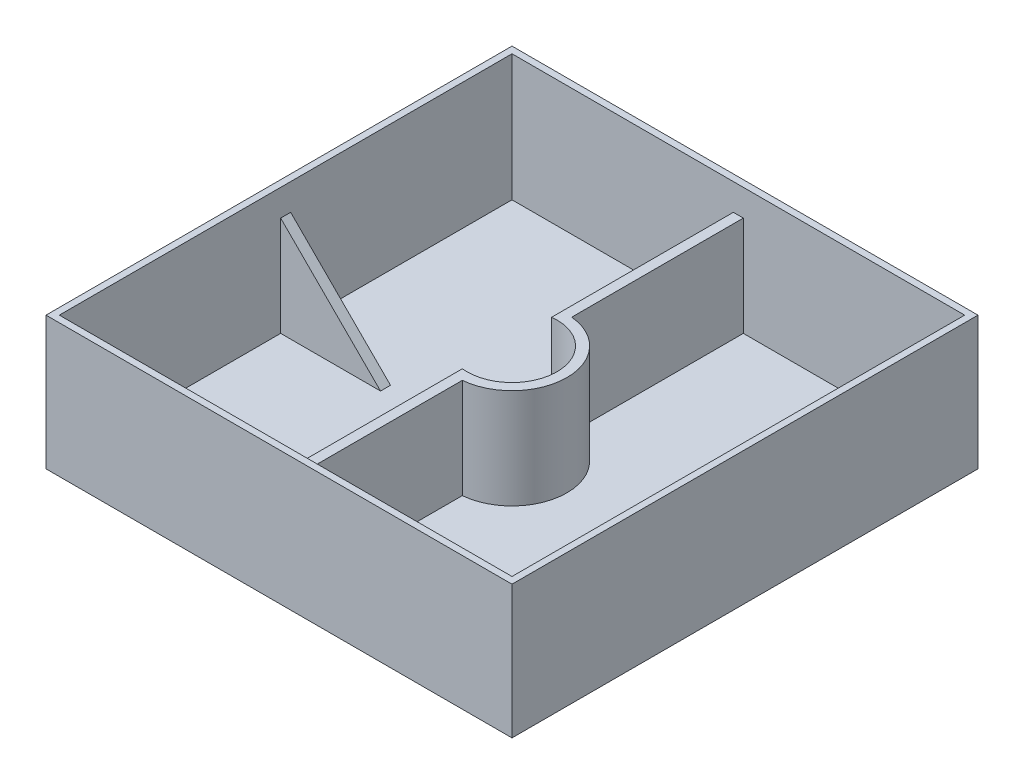
ISO-10303-21;
HEADER;
FILE_DESCRIPTION(('STEP AP214'),'2;1');
FILE_NAME('part.step','',(''),(''),'','','');
FILE_SCHEMA(('AUTOMOTIVE_DESIGN { 1 0 10303 214 1 1 1 1 }'));
ENDSEC;
DATA;
#1=APPLICATION_CONTEXT('core data for automotive mechanical design processes');
#2=APPLICATION_PROTOCOL_DEFINITION('international standard','automotive_design',2000,#1);
#3=PRODUCT_CONTEXT('',#1,'mechanical');
#4=PRODUCT('Part','Part','',(#3));
#5=PRODUCT_RELATED_PRODUCT_CATEGORY('part','',(#4));
#6=PRODUCT_DEFINITION_FORMATION('','',#4);
#7=PRODUCT_DEFINITION_CONTEXT('part definition',#1,'design');
#8=PRODUCT_DEFINITION('design','',#6,#7);
#9=PRODUCT_DEFINITION_SHAPE('','',#8);
#10=(LENGTH_UNIT() NAMED_UNIT(*) SI_UNIT(.MILLI.,.METRE.));
#11=(NAMED_UNIT(*) PLANE_ANGLE_UNIT() SI_UNIT($,.RADIAN.));
#12=(NAMED_UNIT(*) SI_UNIT($,.STERADIAN.) SOLID_ANGLE_UNIT());
#13=UNCERTAINTY_MEASURE_WITH_UNIT(LENGTH_MEASURE(1.E-05),#10,'distance_accuracy_value','');
#14=(GEOMETRIC_REPRESENTATION_CONTEXT(3) GLOBAL_UNCERTAINTY_ASSIGNED_CONTEXT((#13)) GLOBAL_UNIT_ASSIGNED_CONTEXT((#10,
#11,#12)) REPRESENTATION_CONTEXT('',''));
#15=CARTESIAN_POINT('',(0.,0.,0.));
#16=DIRECTION('',(0.,0.,1.));
#17=DIRECTION('',(1.,0.,0.));
#18=AXIS2_PLACEMENT_3D('',#15,#16,#17);
#19=CARTESIAN_POINT('',(0.,2.54,0.));
#20=DIRECTION('',(0.,-1.,0.));
#21=DIRECTION('',(0.,0.,-1.));
#22=AXIS2_PLACEMENT_3D('',#19,#20,#21);
#23=PLANE('',#22);
#24=DIRECTION('',(0.,0.,1.));
#25=VECTOR('',#24,1.);
#26=CARTESIAN_POINT('',(-1.90499999999998,2.54,0.));
#27=LINE('',#26,#25);
#28=CARTESIAN_POINT('',(-1.90500000000004,2.54,-86.36));
#29=VERTEX_POINT('',#28);
#30=CARTESIAN_POINT('',(-1.90499999999999,2.54,-17.0388379885484));
#31=VERTEX_POINT('',#30);
#32=EDGE_CURVE('E339',#29,#31,#27,.T.);
#33=ORIENTED_EDGE('',*,*,#32,.F.);
#34=DIRECTION('',(-1.,0.,0.));
#35=VECTOR('',#34,1.);
#36=CARTESIAN_POINT('',(0.,2.54,-86.36));
#37=LINE('',#36,#35);
#38=CARTESIAN_POINT('',(-86.36,2.54,-86.36));
#39=VERTEX_POINT('',#38);
#40=EDGE_CURVE('E263',#29,#39,#37,.T.);
#41=ORIENTED_EDGE('',*,*,#40,.T.);
#42=DIRECTION('',(0.,0.,1.));
#43=VECTOR('',#42,1.);
#44=CARTESIAN_POINT('',(-86.36,2.54,0.));
#45=LINE('',#44,#43);
#46=CARTESIAN_POINT('',(-86.36,2.54,-1.905));
#47=VERTEX_POINT('',#46);
#48=EDGE_CURVE('E279',#39,#47,#45,.T.);
#49=ORIENTED_EDGE('',*,*,#48,.T.);
#50=DIRECTION('',(-1.,0.,0.));
#51=VECTOR('',#50,1.);
#52=CARTESIAN_POINT('',(0.,2.54,-1.905));
#53=LINE('',#52,#51);
#54=CARTESIAN_POINT('',(-48.26,2.54,-1.905));
#55=VERTEX_POINT('',#54);
#56=EDGE_CURVE('E322',#55,#47,#53,.T.);
#57=ORIENTED_EDGE('',*,*,#56,.F.);
#58=DIRECTION('',(0.,0.,-1.));
#59=VECTOR('',#58,1.);
#60=CARTESIAN_POINT('',(-48.26,2.54,0.));
#61=LINE('',#60,#59);
#62=CARTESIAN_POINT('',(-48.26,2.54,1.905));
#63=VERTEX_POINT('',#62);
#64=EDGE_CURVE('E325',#55,#63,#61,.F.);
#65=ORIENTED_EDGE('',*,*,#64,.T.);
#66=DIRECTION('',(-1.,0.,0.));
#67=VECTOR('',#66,1.);
#68=CARTESIAN_POINT('',(0.,2.54,1.905));
#69=LINE('',#68,#67);
#70=CARTESIAN_POINT('',(-86.36,2.54,1.905));
#71=VERTEX_POINT('',#70);
#72=EDGE_CURVE('E327',#63,#71,#69,.T.);
#73=ORIENTED_EDGE('',*,*,#72,.T.);
#74=CARTESIAN_POINT('',(-86.36,2.54,86.36));
#75=VERTEX_POINT('',#74);
#76=EDGE_CURVE('E276',#71,#75,#45,.T.);
#77=ORIENTED_EDGE('',*,*,#76,.T.);
#78=DIRECTION('',(1.,0.,0.));
#79=VECTOR('',#78,1.);
#80=CARTESIAN_POINT('',(0.,2.54,86.36));
#81=LINE('',#80,#79);
#82=CARTESIAN_POINT('',(-1.90500000000001,2.54,86.36));
#83=VERTEX_POINT('',#82);
#84=EDGE_CURVE('E283',#75,#83,#81,.T.);
#85=ORIENTED_EDGE('',*,*,#84,.T.);
#86=DIRECTION('',(0.,0.,1.));
#87=VECTOR('',#86,1.);
#88=CARTESIAN_POINT('',(-1.90499999999997,2.54,0.));
#89=LINE('',#88,#87);
#90=CARTESIAN_POINT('',(-1.90499999999999,2.54,17.0388379885484));
#91=VERTEX_POINT('',#90);
#92=EDGE_CURVE('E48',#91,#83,#89,.T.);
#93=ORIENTED_EDGE('',*,*,#92,.F.);
#94=CARTESIAN_POINT('',(0.,2.54,0.));
#95=DIRECTION('',(0.,-1.,0.));
#96=DIRECTION('',(0.,0.,-1.));
#97=AXIS2_PLACEMENT_3D('',#94,#95,#96);
#98=CIRCLE('',#97,17.145);
#99=EDGE_CURVE('E337',#31,#91,#98,.T.);
#100=ORIENTED_EDGE('',*,*,#99,.F.);
#101=EDGE_LOOP('',(#33,#41,#49,#57,#65,#73,#77,#85,#93,#100));
#102=FACE_BOUND('',#101,.T.);
#103=ADVANCED_FACE('F33',(#102),#23,.F.);
#104=CARTESIAN_POINT('',(0.,50.8,0.));
#105=DIRECTION('',(0.,-1.,0.));
#106=DIRECTION('',(0.,0.,-1.));
#107=AXIS2_PLACEMENT_3D('',#104,#105,#106);
#108=PLANE('',#107);
#109=DIRECTION('',(0.,0.,-1.));
#110=VECTOR('',#109,1.);
#111=CARTESIAN_POINT('',(88.8999999999999,50.8,88.9));
#112=LINE('',#111,#110);
#113=CARTESIAN_POINT('',(88.8999999999999,50.8,88.9));
#114=VERTEX_POINT('',#113);
#115=CARTESIAN_POINT('',(88.8999999999999,50.8,-88.9));
#116=VERTEX_POINT('',#115);
#117=EDGE_CURVE('E294',#114,#116,#112,.T.);
#118=ORIENTED_EDGE('',*,*,#117,.T.);
#119=DIRECTION('',(-1.,0.,0.));
#120=VECTOR('',#119,1.);
#121=CARTESIAN_POINT('',(-88.9,50.8,-88.9));
#122=LINE('',#121,#120);
#123=CARTESIAN_POINT('',(-88.9,50.8,-88.9));
#124=VERTEX_POINT('',#123);
#125=EDGE_CURVE('E297',#116,#124,#122,.T.);
#126=ORIENTED_EDGE('',*,*,#125,.T.);
#127=DIRECTION('',(0.,0.,1.));
#128=VECTOR('',#127,1.);
#129=CARTESIAN_POINT('',(-88.9,50.8,88.9));
#130=LINE('',#129,#128);
#131=CARTESIAN_POINT('',(-88.9,50.8,88.9));
#132=VERTEX_POINT('',#131);
#133=EDGE_CURVE('E300',#124,#132,#130,.T.);
#134=ORIENTED_EDGE('',*,*,#133,.T.);
#135=DIRECTION('',(1.,0.,0.));
#136=VECTOR('',#135,1.);
#137=CARTESIAN_POINT('',(-88.9,50.8,88.9));
#138=LINE('',#137,#136);
#139=EDGE_CURVE('E302',#132,#114,#138,.T.);
#140=ORIENTED_EDGE('',*,*,#139,.T.);
#141=EDGE_LOOP('',(#118,#126,#134,#140));
#142=FACE_BOUND('',#141,.T.);
#143=DIRECTION('',(0.,0.,-1.));
#144=VECTOR('',#143,1.);
#145=CARTESIAN_POINT('',(86.36,50.8,0.));
#146=LINE('',#145,#144);
#147=CARTESIAN_POINT('',(86.36,50.8,86.36));
#148=VERTEX_POINT('',#147);
#149=CARTESIAN_POINT('',(86.36,50.8,-86.36));
#150=VERTEX_POINT('',#149);
#151=EDGE_CURVE('E286',#148,#150,#146,.T.);
#152=ORIENTED_EDGE('',*,*,#151,.F.);
#153=DIRECTION('',(1.,0.,0.));
#154=VECTOR('',#153,1.);
#155=CARTESIAN_POINT('',(0.,50.8,86.36));
#156=LINE('',#155,#154);
#157=CARTESIAN_POINT('',(-86.36,50.8,86.36));
#158=VERTEX_POINT('',#157);
#159=EDGE_CURVE('E272',#158,#148,#156,.T.);
#160=ORIENTED_EDGE('',*,*,#159,.F.);
#161=DIRECTION('',(0.,0.,1.));
#162=VECTOR('',#161,1.);
#163=CARTESIAN_POINT('',(-86.36,50.8,0.));
#164=LINE('',#163,#162);
#165=CARTESIAN_POINT('',(-86.36,50.8,-86.36));
#166=VERTEX_POINT('',#165);
#167=EDGE_CURVE('E290',#166,#158,#164,.T.);
#168=ORIENTED_EDGE('',*,*,#167,.F.);
#169=DIRECTION('',(-1.,0.,0.));
#170=VECTOR('',#169,1.);
#171=CARTESIAN_POINT('',(0.,50.8,-86.36));
#172=LINE('',#171,#170);
#173=EDGE_CURVE('E288',#150,#166,#172,.T.);
#174=ORIENTED_EDGE('',*,*,#173,.F.);
#175=EDGE_LOOP('',(#152,#160,#168,#174));
#176=FACE_BOUND('',#175,.T.);
#177=ADVANCED_FACE('F384',(#142,#176),#108,.F.);
#178=CARTESIAN_POINT('',(88.8999999999999,50.8,88.9));
#179=DIRECTION('',(-1.,0.,0.));
#180=DIRECTION('',(0.,0.,1.));
#181=AXIS2_PLACEMENT_3D('',#178,#179,#180);
#182=PLANE('',#181);
#183=DIRECTION('',(0.,0.,-1.));
#184=VECTOR('',#183,1.);
#185=CARTESIAN_POINT('',(88.8999999999999,0.,88.9));
#186=LINE('',#185,#184);
#187=CARTESIAN_POINT('',(88.8999999999999,0.,88.9));
#188=VERTEX_POINT('',#187);
#189=CARTESIAN_POINT('',(88.8999999999999,0.,-88.9));
#190=VERTEX_POINT('',#189);
#191=EDGE_CURVE('E267',#188,#190,#186,.T.);
#192=ORIENTED_EDGE('',*,*,#191,.T.);
#193=DIRECTION('',(0.,-1.,0.));
#194=VECTOR('',#193,1.);
#195=CARTESIAN_POINT('',(88.8999999999999,50.8,-88.9));
#196=LINE('',#195,#194);
#197=EDGE_CURVE('E319',#116,#190,#196,.T.);
#198=ORIENTED_EDGE('',*,*,#197,.F.);
#199=ORIENTED_EDGE('',*,*,#117,.F.);
#200=DIRECTION('',(0.,-1.,0.));
#201=VECTOR('',#200,1.);
#202=CARTESIAN_POINT('',(88.8999999999999,50.8,88.9));
#203=LINE('',#202,#201);
#204=EDGE_CURVE('E304',#114,#188,#203,.T.);
#205=ORIENTED_EDGE('',*,*,#204,.T.);
#206=EDGE_LOOP('',(#192,#198,#199,#205));
#207=FACE_BOUND('',#206,.T.);
#208=ADVANCED_FACE('F35',(#207),#182,.F.);
#209=CARTESIAN_POINT('',(-88.9,50.8,-88.9));
#210=DIRECTION('',(0.,0.,1.));
#211=DIRECTION('',(1.,0.,0.));
#212=AXIS2_PLACEMENT_3D('',#209,#210,#211);
#213=PLANE('',#212);
#214=DIRECTION('',(-1.,0.,0.));
#215=VECTOR('',#214,1.);
#216=CARTESIAN_POINT('',(-88.9,0.,-88.9));
#217=LINE('',#216,#215);
#218=CARTESIAN_POINT('',(-88.9,0.,-88.9));
#219=VERTEX_POINT('',#218);
#220=EDGE_CURVE('E306',#190,#219,#217,.T.);
#221=ORIENTED_EDGE('',*,*,#220,.T.);
#222=DIRECTION('',(0.,-1.,0.));
#223=VECTOR('',#222,1.);
#224=CARTESIAN_POINT('',(-88.9,50.8,-88.9));
#225=LINE('',#224,#223);
#226=EDGE_CURVE('E316',#124,#219,#225,.T.);
#227=ORIENTED_EDGE('',*,*,#226,.F.);
#228=ORIENTED_EDGE('',*,*,#125,.F.);
#229=ORIENTED_EDGE('',*,*,#197,.T.);
#230=EDGE_LOOP('',(#221,#227,#228,#229));
#231=FACE_BOUND('',#230,.T.);
#232=ADVANCED_FACE('F445',(#231),#213,.F.);
#233=CARTESIAN_POINT('',(-88.9,50.8,88.9));
#234=DIRECTION('',(1.,0.,0.));
#235=DIRECTION('',(0.,0.,-1.));
#236=AXIS2_PLACEMENT_3D('',#233,#234,#235);
#237=PLANE('',#236);
#238=DIRECTION('',(0.,0.,1.));
#239=VECTOR('',#238,1.);
#240=CARTESIAN_POINT('',(-88.9,0.,88.9));
#241=LINE('',#240,#239);
#242=CARTESIAN_POINT('',(-88.9,0.,88.9));
#243=VERTEX_POINT('',#242);
#244=EDGE_CURVE('E308',#219,#243,#241,.T.);
#245=ORIENTED_EDGE('',*,*,#244,.T.);
#246=DIRECTION('',(0.,-1.,0.));
#247=VECTOR('',#246,1.);
#248=CARTESIAN_POINT('',(-88.9,50.8,88.9));
#249=LINE('',#248,#247);
#250=EDGE_CURVE('E313',#132,#243,#249,.T.);
#251=ORIENTED_EDGE('',*,*,#250,.F.);
#252=ORIENTED_EDGE('',*,*,#133,.F.);
#253=ORIENTED_EDGE('',*,*,#226,.T.);
#254=EDGE_LOOP('',(#245,#251,#252,#253));
#255=FACE_BOUND('',#254,.T.);
#256=ADVANCED_FACE('F439',(#255),#237,.F.);
#257=CARTESIAN_POINT('',(-88.9,50.8,88.9));
#258=DIRECTION('',(0.,0.,-1.));
#259=DIRECTION('',(-1.,0.,0.));
#260=AXIS2_PLACEMENT_3D('',#257,#258,#259);
#261=PLANE('',#260);
#262=DIRECTION('',(1.,0.,0.));
#263=VECTOR('',#262,1.);
#264=CARTESIAN_POINT('',(-88.9,0.,88.9));
#265=LINE('',#264,#263);
#266=EDGE_CURVE('E298',#243,#188,#265,.T.);
#267=ORIENTED_EDGE('',*,*,#266,.T.);
#268=ORIENTED_EDGE('',*,*,#204,.F.);
#269=ORIENTED_EDGE('',*,*,#139,.F.);
#270=ORIENTED_EDGE('',*,*,#250,.T.);
#271=EDGE_LOOP('',(#267,#268,#269,#270));
#272=FACE_BOUND('',#271,.T.);
#273=ADVANCED_FACE('F433',(#272),#261,.F.);
#274=CARTESIAN_POINT('',(0.,0.,0.));
#275=DIRECTION('',(0.,-1.,0.));
#276=DIRECTION('',(0.,0.,-1.));
#277=AXIS2_PLACEMENT_3D('',#274,#275,#276);
#278=PLANE('',#277);
#279=ORIENTED_EDGE('',*,*,#244,.F.);
#280=ORIENTED_EDGE('',*,*,#220,.F.);
#281=ORIENTED_EDGE('',*,*,#191,.F.);
#282=ORIENTED_EDGE('',*,*,#266,.F.);
#283=EDGE_LOOP('',(#279,#280,#281,#282));
#284=FACE_BOUND('',#283,.T.);
#285=ADVANCED_FACE('F429',(#284),#278,.T.);
#286=CARTESIAN_POINT('',(86.36,50.8,88.9));
#287=DIRECTION('',(-1.,0.,0.));
#288=DIRECTION('',(0.,0.,1.));
#289=AXIS2_PLACEMENT_3D('',#286,#287,#288);
#290=PLANE('',#289);
#291=DIRECTION('',(0.,1.,0.));
#292=VECTOR('',#291,1.);
#293=CARTESIAN_POINT('',(86.36,50.8,1.905));
#294=LINE('',#293,#292);
#295=CARTESIAN_POINT('',(86.36,2.54,1.905));
#296=VERTEX_POINT('',#295);
#297=CARTESIAN_POINT('',(86.36,40.6399999999995,1.905));
#298=VERTEX_POINT('',#297);
#299=EDGE_CURVE('E241',#296,#298,#294,.T.);
#300=ORIENTED_EDGE('',*,*,#299,.F.);
#301=DIRECTION('',(0.,0.,-1.));
#302=VECTOR('',#301,1.);
#303=CARTESIAN_POINT('',(86.36,2.54,0.));
#304=LINE('',#303,#302);
#305=CARTESIAN_POINT('',(86.36,2.54,86.36));
#306=VERTEX_POINT('',#305);
#307=EDGE_CURVE('E260',#306,#296,#304,.T.);
#308=ORIENTED_EDGE('',*,*,#307,.F.);
#309=DIRECTION('',(0.,-1.,0.));
#310=VECTOR('',#309,1.);
#311=CARTESIAN_POINT('',(86.36,50.8,86.36));
#312=LINE('',#311,#310);
#313=EDGE_CURVE('E269',#148,#306,#312,.T.);
#314=ORIENTED_EDGE('',*,*,#313,.F.);
#315=ORIENTED_EDGE('',*,*,#151,.T.);
#316=DIRECTION('',(0.,-1.,0.));
#317=VECTOR('',#316,1.);
#318=CARTESIAN_POINT('',(86.3599999999999,50.8,-86.36));
#319=LINE('',#318,#317);
#320=CARTESIAN_POINT('',(86.36,2.54,-86.36));
#321=VERTEX_POINT('',#320);
#322=EDGE_CURVE('E264',#150,#321,#319,.T.);
#323=ORIENTED_EDGE('',*,*,#322,.T.);
#324=CARTESIAN_POINT('',(86.36,2.54,-1.905));
#325=VERTEX_POINT('',#324);
#326=EDGE_CURVE('E259',#325,#321,#304,.T.);
#327=ORIENTED_EDGE('',*,*,#326,.F.);
#328=DIRECTION('',(0.,1.,0.));
#329=VECTOR('',#328,1.);
#330=CARTESIAN_POINT('',(86.36,50.8,-1.905));
#331=LINE('',#330,#329);
#332=CARTESIAN_POINT('',(86.36,40.6399999999995,-1.905));
#333=VERTEX_POINT('',#332);
#334=EDGE_CURVE('E237',#325,#333,#331,.T.);
#335=ORIENTED_EDGE('',*,*,#334,.T.);
#336=DIRECTION('',(0.,0.,-1.));
#337=VECTOR('',#336,1.);
#338=CARTESIAN_POINT('',(86.36,40.6399999999995,88.9));
#339=LINE('',#338,#337);
#340=EDGE_CURVE('E56',#298,#333,#339,.T.);
#341=ORIENTED_EDGE('',*,*,#340,.F.);
#342=EDGE_LOOP('',(#300,#308,#314,#315,#323,#327,#335,#341));
#343=FACE_BOUND('',#342,.T.);
#344=ADVANCED_FACE('F382',(#343),#290,.T.);
#345=CARTESIAN_POINT('',(-88.9,50.8,-86.36));
#346=DIRECTION('',(0.,0.,1.));
#347=DIRECTION('',(1.,0.,0.));
#348=AXIS2_PLACEMENT_3D('',#345,#346,#347);
#349=PLANE('',#348);
#350=DIRECTION('',(0.,1.,0.));
#351=VECTOR('',#350,1.);
#352=CARTESIAN_POINT('',(1.90499999999996,40.64,-86.36));
#353=LINE('',#352,#351);
#354=CARTESIAN_POINT('',(1.90499999999996,40.64,-86.36));
#355=VERTEX_POINT('',#354);
#356=CARTESIAN_POINT('',(1.90499999999996,2.54,-86.36));
#357=VERTEX_POINT('',#356);
#358=EDGE_CURVE('E204',#355,#357,#353,.F.);
#359=ORIENTED_EDGE('',*,*,#358,.T.);
#360=EDGE_CURVE('E273',#321,#357,#37,.T.);
#361=ORIENTED_EDGE('',*,*,#360,.F.);
#362=ORIENTED_EDGE('',*,*,#322,.F.);
#363=ORIENTED_EDGE('',*,*,#173,.T.);
#364=DIRECTION('',(0.,-1.,0.));
#365=VECTOR('',#364,1.);
#366=CARTESIAN_POINT('',(-86.36,50.8,-86.36));
#367=LINE('',#366,#365);
#368=EDGE_CURVE('E268',#166,#39,#367,.T.);
#369=ORIENTED_EDGE('',*,*,#368,.T.);
#370=ORIENTED_EDGE('',*,*,#40,.F.);
#371=DIRECTION('',(0.,1.,0.));
#372=VECTOR('',#371,1.);
#373=CARTESIAN_POINT('',(-1.90500000000004,40.64,-86.36));
#374=LINE('',#373,#372);
#375=CARTESIAN_POINT('',(-1.90500000000004,40.64,-86.36));
#376=VERTEX_POINT('',#375);
#377=EDGE_CURVE('E221',#376,#29,#374,.F.);
#378=ORIENTED_EDGE('',*,*,#377,.F.);
#379=DIRECTION('',(-1.,0.,0.));
#380=VECTOR('',#379,1.);
#381=CARTESIAN_POINT('',(-88.9,40.64,-86.36));
#382=LINE('',#381,#380);
#383=EDGE_CURVE('E220',#355,#376,#382,.T.);
#384=ORIENTED_EDGE('',*,*,#383,.F.);
#385=EDGE_LOOP('',(#359,#361,#362,#363,#369,#370,#378,#384));
#386=FACE_BOUND('',#385,.T.);
#387=ADVANCED_FACE('F356',(#386),#349,.T.);
#388=CARTESIAN_POINT('',(-86.36,50.8,88.9));
#389=DIRECTION('',(1.,0.,0.));
#390=DIRECTION('',(0.,0.,-1.));
#391=AXIS2_PLACEMENT_3D('',#388,#389,#390);
#392=PLANE('',#391);
#393=DIRECTION('',(0.,-1.,0.));
#394=VECTOR('',#393,1.);
#395=CARTESIAN_POINT('',(-86.36,50.8,1.905));
#396=LINE('',#395,#394);
#397=CARTESIAN_POINT('',(-86.36,40.6399999999996,1.905));
#398=VERTEX_POINT('',#397);
#399=EDGE_CURVE('E253',#398,#71,#396,.T.);
#400=ORIENTED_EDGE('',*,*,#399,.F.);
#401=DIRECTION('',(0.,0.,-1.));
#402=VECTOR('',#401,1.);
#403=CARTESIAN_POINT('',(-86.36,40.6399999999996,88.9));
#404=LINE('',#403,#402);
#405=CARTESIAN_POINT('',(-86.36,40.6399999999996,-1.905));
#406=VERTEX_POINT('',#405);
#407=EDGE_CURVE('E256',#406,#398,#404,.F.);
#408=ORIENTED_EDGE('',*,*,#407,.F.);
#409=DIRECTION('',(0.,-1.,0.));
#410=VECTOR('',#409,1.);
#411=CARTESIAN_POINT('',(-86.36,50.8,-1.905));
#412=LINE('',#411,#410);
#413=EDGE_CURVE('E248',#406,#47,#412,.T.);
#414=ORIENTED_EDGE('',*,*,#413,.T.);
#415=ORIENTED_EDGE('',*,*,#48,.F.);
#416=ORIENTED_EDGE('',*,*,#368,.F.);
#417=ORIENTED_EDGE('',*,*,#167,.T.);
#418=DIRECTION('',(0.,-1.,0.));
#419=VECTOR('',#418,1.);
#420=CARTESIAN_POINT('',(-86.36,50.8,86.36));
#421=LINE('',#420,#419);
#422=EDGE_CURVE('E271',#158,#75,#421,.T.);
#423=ORIENTED_EDGE('',*,*,#422,.T.);
#424=ORIENTED_EDGE('',*,*,#76,.F.);
#425=EDGE_LOOP('',(#400,#408,#414,#415,#416,#417,#423,#424));
#426=FACE_BOUND('',#425,.T.);
#427=ADVANCED_FACE('F374',(#426),#392,.T.);
#428=CARTESIAN_POINT('',(-88.9,50.8,86.36));
#429=DIRECTION('',(0.,0.,-1.));
#430=DIRECTION('',(-1.,0.,0.));
#431=AXIS2_PLACEMENT_3D('',#428,#429,#430);
#432=PLANE('',#431);
#433=DIRECTION('',(0.,1.,0.));
#434=VECTOR('',#433,1.);
#435=CARTESIAN_POINT('',(1.90499999999996,40.64,86.36));
#436=LINE('',#435,#434);
#437=CARTESIAN_POINT('',(1.90499999999996,40.64,86.36));
#438=VERTEX_POINT('',#437);
#439=CARTESIAN_POINT('',(1.90499999999996,2.54,86.36));
#440=VERTEX_POINT('',#439);
#441=EDGE_CURVE('E194',#438,#440,#436,.F.);
#442=ORIENTED_EDGE('',*,*,#441,.F.);
#443=DIRECTION('',(1.,0.,0.));
#444=VECTOR('',#443,1.);
#445=CARTESIAN_POINT('',(-88.9,40.64,86.36));
#446=LINE('',#445,#444);
#447=CARTESIAN_POINT('',(-1.90500000000004,40.64,86.36));
#448=VERTEX_POINT('',#447);
#449=EDGE_CURVE('E11',#448,#438,#446,.T.);
#450=ORIENTED_EDGE('',*,*,#449,.F.);
#451=DIRECTION('',(0.,1.,0.));
#452=VECTOR('',#451,1.);
#453=CARTESIAN_POINT('',(-1.90500000000004,40.64,86.36));
#454=LINE('',#453,#452);
#455=EDGE_CURVE('E224',#448,#83,#454,.F.);
#456=ORIENTED_EDGE('',*,*,#455,.T.);
#457=ORIENTED_EDGE('',*,*,#84,.F.);
#458=ORIENTED_EDGE('',*,*,#422,.F.);
#459=ORIENTED_EDGE('',*,*,#159,.T.);
#460=ORIENTED_EDGE('',*,*,#313,.T.);
#461=EDGE_CURVE('E203',#440,#306,#81,.T.);
#462=ORIENTED_EDGE('',*,*,#461,.F.);
#463=EDGE_LOOP('',(#442,#450,#456,#457,#458,#459,#460,#462));
#464=FACE_BOUND('',#463,.T.);
#465=ADVANCED_FACE('F201',(#464),#432,.T.);
#466=ORIENTED_EDGE('',*,*,#360,.T.);
#467=DIRECTION('',(0.,0.,1.));
#468=VECTOR('',#467,1.);
#469=CARTESIAN_POINT('',(1.90500000000002,2.54,0.));
#470=LINE('',#469,#468);
#471=CARTESIAN_POINT('',(1.90500000000001,2.54,-20.8682294409468));
#472=VERTEX_POINT('',#471);
#473=EDGE_CURVE('E41',#357,#472,#470,.T.);
#474=ORIENTED_EDGE('',*,*,#473,.T.);
#475=CARTESIAN_POINT('',(0.,2.54,0.));
#476=DIRECTION('',(0.,-1.,0.));
#477=DIRECTION('',(0.,0.,-1.));
#478=AXIS2_PLACEMENT_3D('',#475,#476,#477);
#479=CIRCLE('',#478,20.955);
#480=CARTESIAN_POINT('',(1.90500000000001,2.54,20.8682294409468));
#481=VERTEX_POINT('',#480);
#482=EDGE_CURVE('E343',#472,#481,#479,.T.);
#483=ORIENTED_EDGE('',*,*,#482,.T.);
#484=DIRECTION('',(0.,0.,1.));
#485=VECTOR('',#484,1.);
#486=CARTESIAN_POINT('',(1.90500000000003,2.54,0.));
#487=LINE('',#486,#485);
#488=EDGE_CURVE('E341',#481,#440,#487,.T.);
#489=ORIENTED_EDGE('',*,*,#488,.T.);
#490=ORIENTED_EDGE('',*,*,#461,.T.);
#491=ORIENTED_EDGE('',*,*,#307,.T.);
#492=DIRECTION('',(-1.,0.,0.));
#493=VECTOR('',#492,1.);
#494=CARTESIAN_POINT('',(0.,2.54,1.905));
#495=LINE('',#494,#493);
#496=CARTESIAN_POINT('',(48.26,2.54,1.905));
#497=VERTEX_POINT('',#496);
#498=EDGE_CURVE('E334',#296,#497,#495,.T.);
#499=ORIENTED_EDGE('',*,*,#498,.T.);
#500=DIRECTION('',(0.,0.,-1.));
#501=VECTOR('',#500,1.);
#502=CARTESIAN_POINT('',(48.26,2.54,0.));
#503=LINE('',#502,#501);
#504=CARTESIAN_POINT('',(48.26,2.54,-1.905));
#505=VERTEX_POINT('',#504);
#506=EDGE_CURVE('E332',#497,#505,#503,.T.);
#507=ORIENTED_EDGE('',*,*,#506,.T.);
#508=DIRECTION('',(-1.,0.,0.));
#509=VECTOR('',#508,1.);
#510=CARTESIAN_POINT('',(0.,2.54,-1.905));
#511=LINE('',#510,#509);
#512=EDGE_CURVE('E329',#325,#505,#511,.T.);
#513=ORIENTED_EDGE('',*,*,#512,.F.);
#514=ORIENTED_EDGE('',*,*,#326,.T.);
#515=EDGE_LOOP('',(#466,#474,#483,#489,#490,#491,#499,#507,#513,#514));
#516=FACE_BOUND('',#515,.T.);
#517=ADVANCED_FACE('F347',(#516),#23,.F.);
#518=CARTESIAN_POINT('',(-86.36,40.6399999999996,0.));
#519=DIRECTION('',(-0.707106781186544,-0.707106781186551,0.));
#520=DIRECTION('',(0.707106781186551,-0.707106781186544,0.));
#521=AXIS2_PLACEMENT_3D('',#518,#519,#520);
#522=PLANE('',#521);
#523=DIRECTION('',(0.707106781186551,-0.707106781186544,0.));
#524=VECTOR('',#523,1.);
#525=CARTESIAN_POINT('',(-86.36,40.6399999999996,-1.905));
#526=LINE('',#525,#524);
#527=EDGE_CURVE('E244',#406,#55,#526,.T.);
#528=ORIENTED_EDGE('',*,*,#527,.F.);
#529=ORIENTED_EDGE('',*,*,#407,.T.);
#530=DIRECTION('',(0.707106781186551,-0.707106781186544,0.));
#531=VECTOR('',#530,1.);
#532=CARTESIAN_POINT('',(-86.36,40.6399999999996,1.905));
#533=LINE('',#532,#531);
#534=EDGE_CURVE('E245',#398,#63,#533,.T.);
#535=ORIENTED_EDGE('',*,*,#534,.T.);
#536=ORIENTED_EDGE('',*,*,#64,.F.);
#537=EDGE_LOOP('',(#528,#529,#535,#536));
#538=FACE_BOUND('',#537,.T.);
#539=ADVANCED_FACE('F391',(#538),#522,.F.);
#540=CARTESIAN_POINT('',(0.,25.4,1.905));
#541=DIRECTION('',(0.,0.,1.));
#542=DIRECTION('',(1.,0.,0.));
#543=AXIS2_PLACEMENT_3D('',#540,#541,#542);
#544=PLANE('',#543);
#545=ORIENTED_EDGE('',*,*,#534,.F.);
#546=ORIENTED_EDGE('',*,*,#399,.T.);
#547=ORIENTED_EDGE('',*,*,#72,.F.);
#548=EDGE_LOOP('',(#545,#546,#547));
#549=FACE_BOUND('',#548,.T.);
#550=ADVANCED_FACE('F396',(#549),#544,.T.);
#551=CARTESIAN_POINT('',(0.,25.4,-1.905));
#552=DIRECTION('',(0.,0.,1.));
#553=DIRECTION('',(1.,0.,0.));
#554=AXIS2_PLACEMENT_3D('',#551,#552,#553);
#555=PLANE('',#554);
#556=ORIENTED_EDGE('',*,*,#413,.F.);
#557=ORIENTED_EDGE('',*,*,#527,.T.);
#558=ORIENTED_EDGE('',*,*,#56,.T.);
#559=EDGE_LOOP('',(#556,#557,#558));
#560=FACE_BOUND('',#559,.T.);
#561=ADVANCED_FACE('F393',(#560),#555,.F.);
#562=CARTESIAN_POINT('',(86.36,40.6399999999996,0.));
#563=DIRECTION('',(-0.707106781186544,0.707106781186551,0.));
#564=DIRECTION('',(-0.707106781186551,-0.707106781186544,0.));
#565=AXIS2_PLACEMENT_3D('',#562,#563,#564);
#566=PLANE('',#565);
#567=DIRECTION('',(-0.707106781186551,-0.707106781186544,0.));
#568=VECTOR('',#567,1.);
#569=CARTESIAN_POINT('',(86.36,40.6399999999996,1.905));
#570=LINE('',#569,#568);
#571=EDGE_CURVE('E234',#298,#497,#570,.T.);
#572=ORIENTED_EDGE('',*,*,#571,.F.);
#573=ORIENTED_EDGE('',*,*,#340,.T.);
#574=DIRECTION('',(-0.707106781186551,-0.707106781186544,0.));
#575=VECTOR('',#574,1.);
#576=CARTESIAN_POINT('',(86.36,40.6399999999996,-1.905));
#577=LINE('',#576,#575);
#578=EDGE_CURVE('E233',#333,#505,#577,.T.);
#579=ORIENTED_EDGE('',*,*,#578,.T.);
#580=ORIENTED_EDGE('',*,*,#506,.F.);
#581=EDGE_LOOP('',(#572,#573,#579,#580));
#582=FACE_BOUND('',#581,.T.);
#583=ADVANCED_FACE('F395',(#582),#566,.T.);
#584=CARTESIAN_POINT('',(0.,25.4,1.905));
#585=DIRECTION('',(0.,0.,1.));
#586=DIRECTION('',(1.,0.,0.));
#587=AXIS2_PLACEMENT_3D('',#584,#585,#586);
#588=PLANE('',#587);
#589=ORIENTED_EDGE('',*,*,#498,.F.);
#590=ORIENTED_EDGE('',*,*,#299,.T.);
#591=ORIENTED_EDGE('',*,*,#571,.T.);
#592=EDGE_LOOP('',(#589,#590,#591));
#593=FACE_BOUND('',#592,.T.);
#594=ADVANCED_FACE('F402',(#593),#588,.T.);
#595=CARTESIAN_POINT('',(0.,25.4,-1.905));
#596=DIRECTION('',(0.,0.,1.));
#597=DIRECTION('',(1.,0.,0.));
#598=AXIS2_PLACEMENT_3D('',#595,#596,#597);
#599=PLANE('',#598);
#600=ORIENTED_EDGE('',*,*,#334,.F.);
#601=ORIENTED_EDGE('',*,*,#512,.T.);
#602=ORIENTED_EDGE('',*,*,#578,.F.);
#603=EDGE_LOOP('',(#600,#601,#602));
#604=FACE_BOUND('',#603,.T.);
#605=ADVANCED_FACE('F519',(#604),#599,.F.);
#606=CARTESIAN_POINT('',(1.90500000000001,40.64,-19.05));
#607=DIRECTION('',(1.,0.,0.));
#608=DIRECTION('',(0.,0.,-1.));
#609=AXIS2_PLACEMENT_3D('',#606,#607,#608);
#610=PLANE('',#609);
#611=ORIENTED_EDGE('',*,*,#473,.F.);
#612=ORIENTED_EDGE('',*,*,#358,.F.);
#613=DIRECTION('',(0.,0.,-1.));
#614=VECTOR('',#613,1.);
#615=CARTESIAN_POINT('',(1.90500000000001,40.64,-19.05));
#616=LINE('',#615,#614);
#617=CARTESIAN_POINT('',(1.90500000000001,40.64,-20.8682294409468));
#618=VERTEX_POINT('',#617);
#619=EDGE_CURVE('E217',#355,#618,#616,.F.);
#620=ORIENTED_EDGE('',*,*,#619,.T.);
#621=DIRECTION('',(0.,-1.,0.));
#622=VECTOR('',#621,1.);
#623=CARTESIAN_POINT('',(1.90500000000001,40.64,-20.8682294409468));
#624=LINE('',#623,#622);
#625=EDGE_CURVE('E198',#618,#472,#624,.T.);
#626=ORIENTED_EDGE('',*,*,#625,.T.);
#627=EDGE_LOOP('',(#611,#612,#620,#626));
#628=FACE_BOUND('',#627,.T.);
#629=ADVANCED_FACE('F352',(#628),#610,.T.);
#630=CARTESIAN_POINT('',(0.,40.64,0.));
#631=DIRECTION('',(0.,-1.,0.));
#632=DIRECTION('',(0.,0.,-1.));
#633=AXIS2_PLACEMENT_3D('',#630,#631,#632);
#634=CYLINDRICAL_SURFACE('',#633,20.955);
#635=ORIENTED_EDGE('',*,*,#482,.F.);
#636=ORIENTED_EDGE('',*,*,#625,.F.);
#637=CARTESIAN_POINT('',(0.,40.64,0.));
#638=DIRECTION('',(0.,-1.,0.));
#639=DIRECTION('',(0.,0.,-1.));
#640=AXIS2_PLACEMENT_3D('',#637,#638,#639);
#641=CIRCLE('',#640,20.955);
#642=CARTESIAN_POINT('',(1.90500000000001,40.64,20.8682294409468));
#643=VERTEX_POINT('',#642);
#644=EDGE_CURVE('E215',#618,#643,#641,.T.);
#645=ORIENTED_EDGE('',*,*,#644,.T.);
#646=DIRECTION('',(0.,-1.,0.));
#647=VECTOR('',#646,1.);
#648=CARTESIAN_POINT('',(1.90500000000001,40.64,20.8682294409468));
#649=LINE('',#648,#647);
#650=EDGE_CURVE('E197',#643,#481,#649,.T.);
#651=ORIENTED_EDGE('',*,*,#650,.T.);
#652=EDGE_LOOP('',(#635,#636,#645,#651));
#653=FACE_BOUND('',#652,.T.);
#654=ADVANCED_FACE('F540',(#653),#634,.T.);
#655=CARTESIAN_POINT('',(1.90500000000001,40.64,19.05));
#656=DIRECTION('',(1.,0.,0.));
#657=DIRECTION('',(0.,0.,-1.));
#658=AXIS2_PLACEMENT_3D('',#655,#656,#657);
#659=PLANE('',#658);
#660=ORIENTED_EDGE('',*,*,#488,.F.);
#661=ORIENTED_EDGE('',*,*,#650,.F.);
#662=DIRECTION('',(0.,0.,-1.));
#663=VECTOR('',#662,1.);
#664=CARTESIAN_POINT('',(1.90500000000001,40.64,19.05));
#665=LINE('',#664,#663);
#666=EDGE_CURVE('E185',#643,#438,#665,.F.);
#667=ORIENTED_EDGE('',*,*,#666,.T.);
#668=ORIENTED_EDGE('',*,*,#441,.T.);
#669=EDGE_LOOP('',(#660,#661,#667,#668));
#670=FACE_BOUND('',#669,.T.);
#671=ADVANCED_FACE('F193',(#670),#659,.T.);
#672=CARTESIAN_POINT('',(-1.90499999999999,40.64,-19.05));
#673=DIRECTION('',(1.,0.,0.));
#674=DIRECTION('',(0.,0.,-1.));
#675=AXIS2_PLACEMENT_3D('',#672,#673,#674);
#676=PLANE('',#675);
#677=ORIENTED_EDGE('',*,*,#377,.T.);
#678=ORIENTED_EDGE('',*,*,#32,.T.);
#679=DIRECTION('',(0.,-1.,0.));
#680=VECTOR('',#679,1.);
#681=CARTESIAN_POINT('',(-1.90499999999999,40.64,-17.0388379885484));
#682=LINE('',#681,#680);
#683=CARTESIAN_POINT('',(-1.90499999999999,40.64,-17.0388379885484));
#684=VERTEX_POINT('',#683);
#685=EDGE_CURVE('E225',#684,#31,#682,.T.);
#686=ORIENTED_EDGE('',*,*,#685,.F.);
#687=DIRECTION('',(0.,0.,-1.));
#688=VECTOR('',#687,1.);
#689=CARTESIAN_POINT('',(-1.90499999999999,40.64,-19.05));
#690=LINE('',#689,#688);
#691=EDGE_CURVE('E205',#376,#684,#690,.F.);
#692=ORIENTED_EDGE('',*,*,#691,.F.);
#693=EDGE_LOOP('',(#677,#678,#686,#692));
#694=FACE_BOUND('',#693,.T.);
#695=ADVANCED_FACE('F362',(#694),#676,.F.);
#696=CARTESIAN_POINT('',(0.,40.64,0.));
#697=DIRECTION('',(0.,-1.,0.));
#698=DIRECTION('',(0.,0.,-1.));
#699=AXIS2_PLACEMENT_3D('',#696,#697,#698);
#700=CYLINDRICAL_SURFACE('',#699,17.145);
#701=ORIENTED_EDGE('',*,*,#685,.T.);
#702=ORIENTED_EDGE('',*,*,#99,.T.);
#703=DIRECTION('',(0.,-1.,0.));
#704=VECTOR('',#703,1.);
#705=CARTESIAN_POINT('',(-1.90499999999999,40.64,17.0388379885484));
#706=LINE('',#705,#704);
#707=CARTESIAN_POINT('',(-1.90499999999999,40.64,17.0388379885484));
#708=VERTEX_POINT('',#707);
#709=EDGE_CURVE('E223',#708,#91,#706,.T.);
#710=ORIENTED_EDGE('',*,*,#709,.F.);
#711=CARTESIAN_POINT('',(0.,40.64,0.));
#712=DIRECTION('',(0.,-1.,0.));
#713=DIRECTION('',(0.,0.,-1.));
#714=AXIS2_PLACEMENT_3D('',#711,#712,#713);
#715=CIRCLE('',#714,17.145);
#716=EDGE_CURVE('E210',#684,#708,#715,.T.);
#717=ORIENTED_EDGE('',*,*,#716,.F.);
#718=EDGE_LOOP('',(#701,#702,#710,#717));
#719=FACE_BOUND('',#718,.T.);
#720=ADVANCED_FACE('F367',(#719),#700,.F.);
#721=CARTESIAN_POINT('',(-1.90499999999999,40.64,19.05));
#722=DIRECTION('',(1.,0.,0.));
#723=DIRECTION('',(0.,0.,-1.));
#724=AXIS2_PLACEMENT_3D('',#721,#722,#723);
#725=PLANE('',#724);
#726=ORIENTED_EDGE('',*,*,#709,.T.);
#727=ORIENTED_EDGE('',*,*,#92,.T.);
#728=ORIENTED_EDGE('',*,*,#455,.F.);
#729=DIRECTION('',(0.,0.,-1.));
#730=VECTOR('',#729,1.);
#731=CARTESIAN_POINT('',(-1.90499999999999,40.64,19.05));
#732=LINE('',#731,#730);
#733=EDGE_CURVE('E189',#708,#448,#732,.F.);
#734=ORIENTED_EDGE('',*,*,#733,.F.);
#735=EDGE_LOOP('',(#726,#727,#728,#734));
#736=FACE_BOUND('',#735,.T.);
#737=ADVANCED_FACE('F368',(#736),#725,.F.);
#738=CARTESIAN_POINT('',(0.,40.64,86.36));
#739=DIRECTION('',(0.,1.,0.));
#740=DIRECTION('',(0.,0.,1.));
#741=AXIS2_PLACEMENT_3D('',#738,#739,#740);
#742=PLANE('',#741);
#743=ORIENTED_EDGE('',*,*,#619,.F.);
#744=ORIENTED_EDGE('',*,*,#383,.T.);
#745=ORIENTED_EDGE('',*,*,#691,.T.);
#746=ORIENTED_EDGE('',*,*,#716,.T.);
#747=ORIENTED_EDGE('',*,*,#733,.T.);
#748=ORIENTED_EDGE('',*,*,#449,.T.);
#749=ORIENTED_EDGE('',*,*,#666,.F.);
#750=ORIENTED_EDGE('',*,*,#644,.F.);
#751=EDGE_LOOP('',(#743,#744,#745,#746,#747,#748,#749,#750));
#752=FACE_BOUND('',#751,.T.);
#753=ADVANCED_FACE('F184',(#752),#742,.T.);
#754=CLOSED_SHELL('',(#103,#177,#208,#232,#256,#273,#285,#344,#387,#427,#465,#517,#539,#550,
#561,#583,#594,#605,#629,#654,#671,#695,#720,#737,#753));
#755=MANIFOLD_SOLID_BREP('B2',#754);
#756=ADVANCED_BREP_SHAPE_REPRESENTATION('',(#18,#755),#14);
#757=SHAPE_DEFINITION_REPRESENTATION(#9,#756);
ENDSEC;
END-ISO-10303-21;
